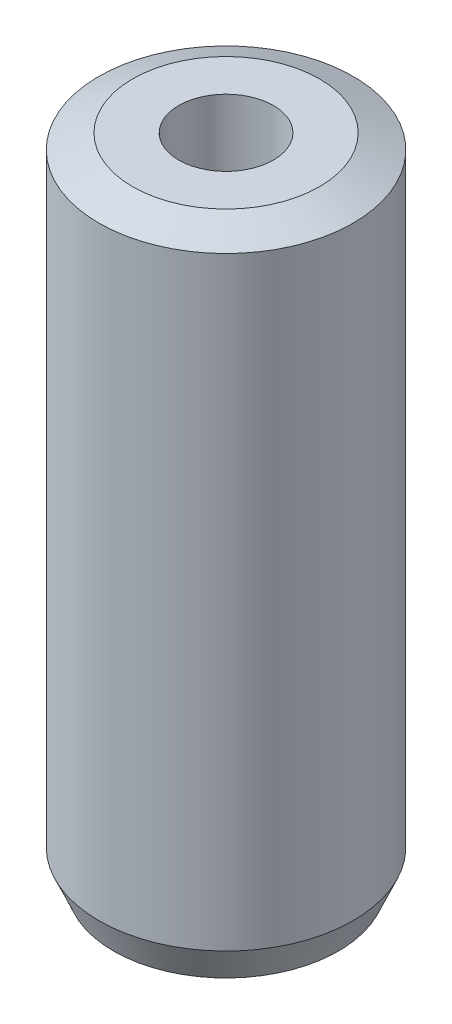
ISO-10303-21;
HEADER;
FILE_DESCRIPTION(('STEP AP214'),'2;1');
FILE_NAME('part.step','',(''),(''),'','','');
FILE_SCHEMA(('AUTOMOTIVE_DESIGN { 1 0 10303 214 1 1 1 1 }'));
ENDSEC;
DATA;
#1=APPLICATION_CONTEXT('core data for automotive mechanical design processes');
#2=APPLICATION_PROTOCOL_DEFINITION('international standard','automotive_design',2000,#1);
#3=PRODUCT_CONTEXT('',#1,'mechanical');
#4=PRODUCT('Part','Part','',(#3));
#5=PRODUCT_RELATED_PRODUCT_CATEGORY('part','',(#4));
#6=PRODUCT_DEFINITION_FORMATION('','',#4);
#7=PRODUCT_DEFINITION_CONTEXT('part definition',#1,'design');
#8=PRODUCT_DEFINITION('design','',#6,#7);
#9=PRODUCT_DEFINITION_SHAPE('','',#8);
#10=(LENGTH_UNIT() NAMED_UNIT(*) SI_UNIT(.MILLI.,.METRE.));
#11=(NAMED_UNIT(*) PLANE_ANGLE_UNIT() SI_UNIT($,.RADIAN.));
#12=(NAMED_UNIT(*) SI_UNIT($,.STERADIAN.) SOLID_ANGLE_UNIT());
#13=UNCERTAINTY_MEASURE_WITH_UNIT(LENGTH_MEASURE(1.E-05),#10,'distance_accuracy_value','');
#14=(GEOMETRIC_REPRESENTATION_CONTEXT(3) GLOBAL_UNCERTAINTY_ASSIGNED_CONTEXT((#13)) GLOBAL_UNIT_ASSIGNED_CONTEXT((#10,
#11,#12)) REPRESENTATION_CONTEXT('',''));
#15=CARTESIAN_POINT('',(0.,0.,0.));
#16=DIRECTION('',(0.,0.,1.));
#17=DIRECTION('',(1.,0.,0.));
#18=AXIS2_PLACEMENT_3D('',#15,#16,#17);
#19=CARTESIAN_POINT('',(0.,38.491571500815,0.));
#20=DIRECTION('',(0.,-1.,0.));
#21=DIRECTION('',(0.,0.,-1.));
#22=AXIS2_PLACEMENT_3D('',#19,#20,#21);
#23=CYLINDRICAL_SURFACE('',#22,7.5);
#24=CARTESIAN_POINT('',(0.,37.6255872207276,0.));
#25=DIRECTION('',(0.,1.,0.));
#26=DIRECTION('',(0.,0.,1.));
#27=AXIS2_PLACEMENT_3D('',#24,#25,#26);
#28=CIRCLE('',#27,7.5);
#29=CARTESIAN_POINT('',(0.,37.6255872207276,7.5));
#30=VERTEX_POINT('',#29);
#31=EDGE_CURVE('E50',#30,#30,#28,.F.);
#32=ORIENTED_EDGE('',*,*,#31,.T.);
#33=EDGE_LOOP('',(#32));
#34=FACE_BOUND('',#33,.T.);
#35=CARTESIAN_POINT('',(0.,1.98860654624881,0.));
#36=DIRECTION('',(0.,1.,0.));
#37=DIRECTION('',(0.,0.,1.));
#38=AXIS2_PLACEMENT_3D('',#35,#36,#37);
#39=CIRCLE('',#38,7.5);
#40=CARTESIAN_POINT('',(0.,1.98860654624881,7.5));
#41=VERTEX_POINT('',#40);
#42=EDGE_CURVE('E51',#41,#41,#39,.T.);
#43=ORIENTED_EDGE('',*,*,#42,.T.);
#44=EDGE_LOOP('',(#43));
#45=FACE_BOUND('',#44,.T.);
#46=ADVANCED_FACE('F39',(#34,#45),#23,.T.);
#47=CARTESIAN_POINT('',(0.,38.491571500815,0.));
#48=DIRECTION('',(0.,1.,0.));
#49=DIRECTION('',(0.,0.,1.));
#50=AXIS2_PLACEMENT_3D('',#47,#48,#49);
#51=PLANE('',#50);
#52=CARTESIAN_POINT('',(0.,38.491571500815,0.));
#53=DIRECTION('',(0.,1.,0.));
#54=DIRECTION('',(0.,0.,1.));
#55=AXIS2_PLACEMENT_3D('',#52,#53,#54);
#56=CIRCLE('',#55,5.51139345375121);
#57=CARTESIAN_POINT('',(0.,38.491571500815,5.51139345375121));
#58=VERTEX_POINT('',#57);
#59=EDGE_CURVE('E54',#58,#58,#56,.T.);
#60=ORIENTED_EDGE('',*,*,#59,.T.);
#61=EDGE_LOOP('',(#60));
#62=FACE_BOUND('',#61,.T.);
#63=CARTESIAN_POINT('',(0.,38.491571500815,0.));
#64=DIRECTION('',(0.,1.,0.));
#65=DIRECTION('',(0.,0.,1.));
#66=AXIS2_PLACEMENT_3D('',#63,#64,#65);
#67=CIRCLE('',#66,2.79129038928065);
#68=CARTESIAN_POINT('',(0.,38.491571500815,2.79129038928065));
#69=VERTEX_POINT('',#68);
#70=EDGE_CURVE('E58',#69,#69,#67,.T.);
#71=ORIENTED_EDGE('',*,*,#70,.F.);
#72=EDGE_LOOP('',(#71));
#73=FACE_BOUND('',#72,.T.);
#74=ADVANCED_FACE('F69',(#62,#73),#51,.T.);
#75=CARTESIAN_POINT('',(0.,0.,0.));
#76=DIRECTION('',(0.,1.,0.));
#77=DIRECTION('',(0.,0.,1.));
#78=AXIS2_PLACEMENT_3D('',#75,#76,#77);
#79=PLANE('',#78);
#80=CARTESIAN_POINT('',(0.,0.,0.));
#81=DIRECTION('',(0.,1.,0.));
#82=DIRECTION('',(0.,0.,1.));
#83=AXIS2_PLACEMENT_3D('',#80,#81,#82);
#84=CIRCLE('',#83,6.63401571991267);
#85=CARTESIAN_POINT('',(0.,0.,6.63401571991267));
#86=VERTEX_POINT('',#85);
#87=EDGE_CURVE('E10',#86,#86,#84,.F.);
#88=ORIENTED_EDGE('',*,*,#87,.T.);
#89=EDGE_LOOP('',(#88));
#90=FACE_BOUND('',#89,.T.);
#91=CARTESIAN_POINT('',(0.,0.,0.));
#92=DIRECTION('',(0.,1.,0.));
#93=DIRECTION('',(0.,0.,1.));
#94=AXIS2_PLACEMENT_3D('',#91,#92,#93);
#95=CIRCLE('',#94,2.79129038928065);
#96=CARTESIAN_POINT('',(0.,0.,2.79129038928065));
#97=VERTEX_POINT('',#96);
#98=EDGE_CURVE('E63',#97,#97,#95,.T.);
#99=ORIENTED_EDGE('',*,*,#98,.T.);
#100=EDGE_LOOP('',(#99));
#101=FACE_BOUND('',#100,.T.);
#102=ADVANCED_FACE('F75',(#90,#101),#79,.F.);
#103=CARTESIAN_POINT('',(0.,38.491571500815,0.));
#104=DIRECTION('',(0.,-1.,0.));
#105=DIRECTION('',(0.,0.,-1.));
#106=AXIS2_PLACEMENT_3D('',#103,#104,#105);
#107=CYLINDRICAL_SURFACE('',#106,2.79129038928065);
#108=ORIENTED_EDGE('',*,*,#70,.T.);
#109=EDGE_LOOP('',(#108));
#110=FACE_BOUND('',#109,.T.);
#111=ORIENTED_EDGE('',*,*,#98,.F.);
#112=EDGE_LOOP('',(#111));
#113=FACE_BOUND('',#112,.T.);
#114=ADVANCED_FACE('F70',(#110,#113),#107,.F.);
#115=CARTESIAN_POINT('',(0.,38.491571500815,0.));
#116=DIRECTION('',(0.,-1.,0.));
#117=DIRECTION('',(0.,0.,-1.));
#118=AXIS2_PLACEMENT_3D('',#115,#116,#117);
#119=CONICAL_SURFACE('',#118,5.51139345375121,1.1600885771224);
#120=ORIENTED_EDGE('',*,*,#31,.F.);
#121=EDGE_LOOP('',(#120));
#122=FACE_BOUND('',#121,.T.);
#123=ORIENTED_EDGE('',*,*,#59,.F.);
#124=EDGE_LOOP('',(#123));
#125=FACE_BOUND('',#124,.T.);
#126=ADVANCED_FACE('F81',(#122,#125),#119,.T.);
#127=CARTESIAN_POINT('',(0.,1.98860654624881,0.));
#128=DIRECTION('',(0.,1.,0.));
#129=DIRECTION('',(0.,0.,1.));
#130=AXIS2_PLACEMENT_3D('',#127,#128,#129);
#131=CONICAL_SURFACE('',#130,7.5,0.410707749672493);
#132=ORIENTED_EDGE('',*,*,#87,.F.);
#133=EDGE_LOOP('',(#132));
#134=FACE_BOUND('',#133,.T.);
#135=ORIENTED_EDGE('',*,*,#42,.F.);
#136=EDGE_LOOP('',(#135));
#137=FACE_BOUND('',#136,.T.);
#138=ADVANCED_FACE('F45',(#134,#137),#131,.T.);
#139=CLOSED_SHELL('',(#46,#74,#102,#114,#126,#138));
#140=MANIFOLD_SOLID_BREP('B2',#139);
#141=ADVANCED_BREP_SHAPE_REPRESENTATION('',(#18,#140),#14);
#142=SHAPE_DEFINITION_REPRESENTATION(#9,#141);
ENDSEC;
END-ISO-10303-21;
